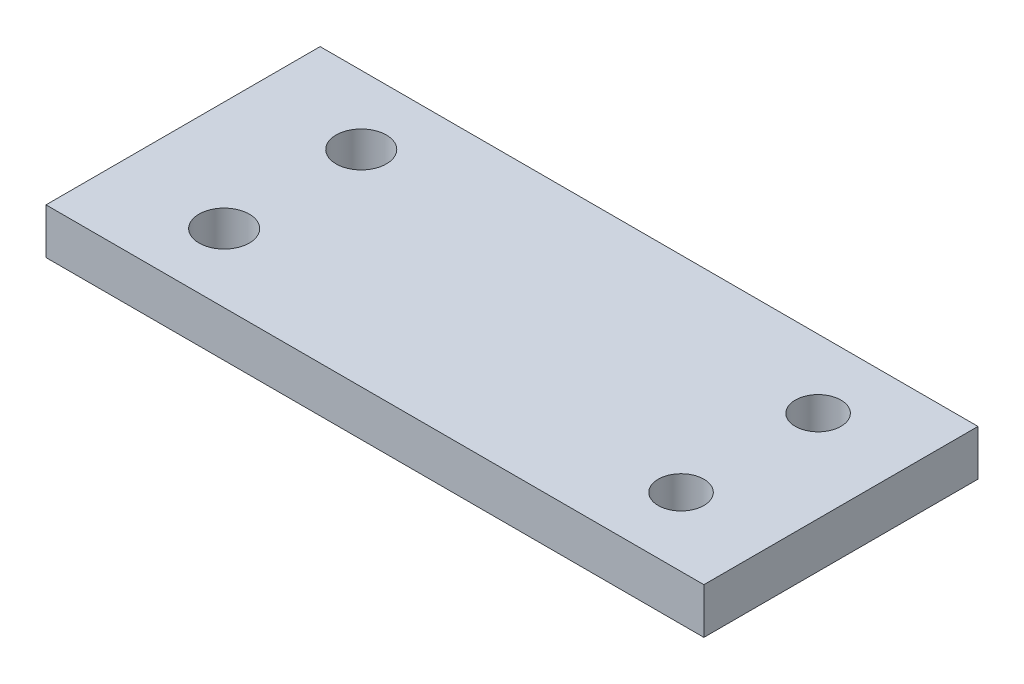
ISO-10303-21;
HEADER;
FILE_DESCRIPTION(('STEP AP214'),'2;1');
FILE_NAME('part.step','',(''),(''),'','','');
FILE_SCHEMA(('AUTOMOTIVE_DESIGN { 1 0 10303 214 1 1 1 1 }'));
ENDSEC;
DATA;
#1=APPLICATION_CONTEXT('core data for automotive mechanical design processes');
#2=APPLICATION_PROTOCOL_DEFINITION('international standard','automotive_design',2000,#1);
#3=PRODUCT_CONTEXT('',#1,'mechanical');
#4=PRODUCT('Part','Part','',(#3));
#5=PRODUCT_RELATED_PRODUCT_CATEGORY('part','',(#4));
#6=PRODUCT_DEFINITION_FORMATION('','',#4);
#7=PRODUCT_DEFINITION_CONTEXT('part definition',#1,'design');
#8=PRODUCT_DEFINITION('design','',#6,#7);
#9=PRODUCT_DEFINITION_SHAPE('','',#8);
#10=(LENGTH_UNIT() NAMED_UNIT(*) SI_UNIT(.MILLI.,.METRE.));
#11=(NAMED_UNIT(*) PLANE_ANGLE_UNIT() SI_UNIT($,.RADIAN.));
#12=(NAMED_UNIT(*) SI_UNIT($,.STERADIAN.) SOLID_ANGLE_UNIT());
#13=UNCERTAINTY_MEASURE_WITH_UNIT(LENGTH_MEASURE(1.E-05),#10,'distance_accuracy_value','');
#14=(GEOMETRIC_REPRESENTATION_CONTEXT(3) GLOBAL_UNCERTAINTY_ASSIGNED_CONTEXT((#13)) GLOBAL_UNIT_ASSIGNED_CONTEXT((#10,
#11,#12)) REPRESENTATION_CONTEXT('',''));
#15=CARTESIAN_POINT('',(0.,0.,0.));
#16=DIRECTION('',(0.,0.,1.));
#17=DIRECTION('',(1.,0.,0.));
#18=AXIS2_PLACEMENT_3D('',#15,#16,#17);
#19=CARTESIAN_POINT('',(36.,5.,-15.));
#20=DIRECTION('',(-1.,0.,0.));
#21=DIRECTION('',(0.,0.,1.));
#22=AXIS2_PLACEMENT_3D('',#19,#20,#21);
#23=PLANE('',#22);
#24=DIRECTION('',(0.,0.,-1.));
#25=VECTOR('',#24,1.);
#26=CARTESIAN_POINT('',(36.,0.,-15.));
#27=LINE('',#26,#25);
#28=CARTESIAN_POINT('',(36.,0.,15.));
#29=VERTEX_POINT('',#28);
#30=CARTESIAN_POINT('',(36.,0.,-15.));
#31=VERTEX_POINT('',#30);
#32=EDGE_CURVE('E97',#29,#31,#27,.T.);
#33=ORIENTED_EDGE('',*,*,#32,.T.);
#34=DIRECTION('',(0.,-1.,0.));
#35=VECTOR('',#34,1.);
#36=CARTESIAN_POINT('',(36.,5.,-15.));
#37=LINE('',#36,#35);
#38=CARTESIAN_POINT('',(36.,5.,-15.));
#39=VERTEX_POINT('',#38);
#40=EDGE_CURVE('E11',#39,#31,#37,.T.);
#41=ORIENTED_EDGE('',*,*,#40,.F.);
#42=DIRECTION('',(0.,0.,-1.));
#43=VECTOR('',#42,1.);
#44=CARTESIAN_POINT('',(36.,5.,-15.));
#45=LINE('',#44,#43);
#46=CARTESIAN_POINT('',(36.,5.,15.));
#47=VERTEX_POINT('',#46);
#48=EDGE_CURVE('E85',#47,#39,#45,.T.);
#49=ORIENTED_EDGE('',*,*,#48,.F.);
#50=DIRECTION('',(0.,-1.,0.));
#51=VECTOR('',#50,1.);
#52=CARTESIAN_POINT('',(36.,5.,15.));
#53=LINE('',#52,#51);
#54=EDGE_CURVE('E93',#47,#29,#53,.T.);
#55=ORIENTED_EDGE('',*,*,#54,.T.);
#56=EDGE_LOOP('',(#33,#41,#49,#55));
#57=FACE_BOUND('',#56,.T.);
#58=ADVANCED_FACE('F34',(#57),#23,.F.);
#59=CARTESIAN_POINT('',(-36.,5.,-15.));
#60=DIRECTION('',(0.,0.,1.));
#61=DIRECTION('',(1.,0.,0.));
#62=AXIS2_PLACEMENT_3D('',#59,#60,#61);
#63=PLANE('',#62);
#64=DIRECTION('',(-1.,0.,0.));
#65=VECTOR('',#64,1.);
#66=CARTESIAN_POINT('',(-36.,0.,-15.));
#67=LINE('',#66,#65);
#68=CARTESIAN_POINT('',(-36.,0.,-15.));
#69=VERTEX_POINT('',#68);
#70=EDGE_CURVE('E89',#31,#69,#67,.T.);
#71=ORIENTED_EDGE('',*,*,#70,.T.);
#72=DIRECTION('',(0.,-1.,0.));
#73=VECTOR('',#72,1.);
#74=CARTESIAN_POINT('',(-36.,5.,-15.));
#75=LINE('',#74,#73);
#76=CARTESIAN_POINT('',(-36.,5.,-15.));
#77=VERTEX_POINT('',#76);
#78=EDGE_CURVE('E42',#77,#69,#75,.T.);
#79=ORIENTED_EDGE('',*,*,#78,.F.);
#80=DIRECTION('',(-1.,0.,0.));
#81=VECTOR('',#80,1.);
#82=CARTESIAN_POINT('',(-36.,5.,-15.));
#83=LINE('',#82,#81);
#84=EDGE_CURVE('E80',#39,#77,#83,.T.);
#85=ORIENTED_EDGE('',*,*,#84,.F.);
#86=ORIENTED_EDGE('',*,*,#40,.T.);
#87=EDGE_LOOP('',(#71,#79,#85,#86));
#88=FACE_BOUND('',#87,.T.);
#89=ADVANCED_FACE('F88',(#88),#63,.F.);
#90=CARTESIAN_POINT('',(-36.,5.,-15.));
#91=DIRECTION('',(1.,0.,0.));
#92=DIRECTION('',(0.,0.,-1.));
#93=AXIS2_PLACEMENT_3D('',#90,#91,#92);
#94=PLANE('',#93);
#95=DIRECTION('',(0.,0.,1.));
#96=VECTOR('',#95,1.);
#97=CARTESIAN_POINT('',(-36.,0.,-15.));
#98=LINE('',#97,#96);
#99=CARTESIAN_POINT('',(-36.,0.,15.));
#100=VERTEX_POINT('',#99);
#101=EDGE_CURVE('E67',#69,#100,#98,.T.);
#102=ORIENTED_EDGE('',*,*,#101,.T.);
#103=DIRECTION('',(0.,-1.,0.));
#104=VECTOR('',#103,1.);
#105=CARTESIAN_POINT('',(-36.,5.,15.));
#106=LINE('',#105,#104);
#107=CARTESIAN_POINT('',(-36.,5.,15.));
#108=VERTEX_POINT('',#107);
#109=EDGE_CURVE('E90',#108,#100,#106,.T.);
#110=ORIENTED_EDGE('',*,*,#109,.F.);
#111=DIRECTION('',(0.,0.,1.));
#112=VECTOR('',#111,1.);
#113=CARTESIAN_POINT('',(-36.,5.,-15.));
#114=LINE('',#113,#112);
#115=EDGE_CURVE('E83',#77,#108,#114,.T.);
#116=ORIENTED_EDGE('',*,*,#115,.F.);
#117=ORIENTED_EDGE('',*,*,#78,.T.);
#118=EDGE_LOOP('',(#102,#110,#116,#117));
#119=FACE_BOUND('',#118,.T.);
#120=ADVANCED_FACE('F91',(#119),#94,.F.);
#121=CARTESIAN_POINT('',(-36.,5.,15.));
#122=DIRECTION('',(0.,0.,-1.));
#123=DIRECTION('',(-1.,0.,0.));
#124=AXIS2_PLACEMENT_3D('',#121,#122,#123);
#125=PLANE('',#124);
#126=DIRECTION('',(1.,0.,0.));
#127=VECTOR('',#126,1.);
#128=CARTESIAN_POINT('',(-36.,0.,15.));
#129=LINE('',#128,#127);
#130=EDGE_CURVE('E73',#100,#29,#129,.T.);
#131=ORIENTED_EDGE('',*,*,#130,.T.);
#132=ORIENTED_EDGE('',*,*,#54,.F.);
#133=DIRECTION('',(1.,0.,0.));
#134=VECTOR('',#133,1.);
#135=CARTESIAN_POINT('',(-36.,5.,15.));
#136=LINE('',#135,#134);
#137=EDGE_CURVE('E50',#108,#47,#136,.T.);
#138=ORIENTED_EDGE('',*,*,#137,.F.);
#139=ORIENTED_EDGE('',*,*,#109,.T.);
#140=EDGE_LOOP('',(#131,#132,#138,#139));
#141=FACE_BOUND('',#140,.T.);
#142=ADVANCED_FACE('F105',(#141),#125,.F.);
#143=CARTESIAN_POINT('',(0.,5.,0.));
#144=DIRECTION('',(0.,1.,0.));
#145=DIRECTION('',(0.,0.,1.));
#146=AXIS2_PLACEMENT_3D('',#143,#144,#145);
#147=PLANE('',#146);
#148=CARTESIAN_POINT('',(-24.,5.,7.5));
#149=DIRECTION('',(0.,1.,0.));
#150=DIRECTION('',(0.,0.,1.));
#151=AXIS2_PLACEMENT_3D('',#148,#149,#150);
#152=CIRCLE('',#151,2.75);
#153=CARTESIAN_POINT('',(-24.,5.,10.25));
#154=VERTEX_POINT('',#153);
#155=EDGE_CURVE('E129',#154,#154,#152,.T.);
#156=ORIENTED_EDGE('',*,*,#155,.F.);
#157=EDGE_LOOP('',(#156));
#158=FACE_BOUND('',#157,.T.);
#159=CARTESIAN_POINT('',(26.,5.,-7.5));
#160=DIRECTION('',(0.,1.,0.));
#161=DIRECTION('',(0.,0.,1.));
#162=AXIS2_PLACEMENT_3D('',#159,#160,#161);
#163=CIRCLE('',#162,2.5);
#164=CARTESIAN_POINT('',(26.,5.,-5.));
#165=VERTEX_POINT('',#164);
#166=EDGE_CURVE('E123',#165,#165,#163,.T.);
#167=ORIENTED_EDGE('',*,*,#166,.F.);
#168=EDGE_LOOP('',(#167));
#169=FACE_BOUND('',#168,.T.);
#170=CARTESIAN_POINT('',(26.,5.,7.5));
#171=DIRECTION('',(0.,1.,0.));
#172=DIRECTION('',(0.,0.,1.));
#173=AXIS2_PLACEMENT_3D('',#170,#171,#172);
#174=CIRCLE('',#173,2.5);
#175=CARTESIAN_POINT('',(26.,5.,10.));
#176=VERTEX_POINT('',#175);
#177=EDGE_CURVE('E117',#176,#176,#174,.T.);
#178=ORIENTED_EDGE('',*,*,#177,.F.);
#179=EDGE_LOOP('',(#178));
#180=FACE_BOUND('',#179,.T.);
#181=CARTESIAN_POINT('',(-24.,5.,-7.5));
#182=DIRECTION('',(0.,1.,0.));
#183=DIRECTION('',(0.,0.,1.));
#184=AXIS2_PLACEMENT_3D('',#181,#182,#183);
#185=CIRCLE('',#184,2.75);
#186=CARTESIAN_POINT('',(-24.,5.,-4.75));
#187=VERTEX_POINT('',#186);
#188=EDGE_CURVE('E111',#187,#187,#185,.T.);
#189=ORIENTED_EDGE('',*,*,#188,.F.);
#190=EDGE_LOOP('',(#189));
#191=FACE_BOUND('',#190,.T.);
#192=ORIENTED_EDGE('',*,*,#48,.T.);
#193=ORIENTED_EDGE('',*,*,#84,.T.);
#194=ORIENTED_EDGE('',*,*,#115,.T.);
#195=ORIENTED_EDGE('',*,*,#137,.T.);
#196=EDGE_LOOP('',(#192,#193,#194,#195));
#197=FACE_BOUND('',#196,.T.);
#198=ADVANCED_FACE('F81',(#158,#169,#180,#191,#197),#147,.T.);
#199=CARTESIAN_POINT('',(0.,0.,0.));
#200=DIRECTION('',(0.,1.,0.));
#201=DIRECTION('',(0.,0.,1.));
#202=AXIS2_PLACEMENT_3D('',#199,#200,#201);
#203=PLANE('',#202);
#204=CARTESIAN_POINT('',(-24.,0.,7.5));
#205=DIRECTION('',(0.,1.,0.));
#206=DIRECTION('',(0.,0.,1.));
#207=AXIS2_PLACEMENT_3D('',#204,#205,#206);
#208=CIRCLE('',#207,2.75);
#209=CARTESIAN_POINT('',(-24.,0.,10.25));
#210=VERTEX_POINT('',#209);
#211=EDGE_CURVE('E114',#210,#210,#208,.T.);
#212=ORIENTED_EDGE('',*,*,#211,.T.);
#213=EDGE_LOOP('',(#212));
#214=FACE_BOUND('',#213,.T.);
#215=CARTESIAN_POINT('',(26.,0.,-7.5));
#216=DIRECTION('',(0.,1.,0.));
#217=DIRECTION('',(0.,0.,1.));
#218=AXIS2_PLACEMENT_3D('',#215,#216,#217);
#219=CIRCLE('',#218,2.5);
#220=CARTESIAN_POINT('',(26.,0.,-5.));
#221=VERTEX_POINT('',#220);
#222=EDGE_CURVE('E126',#221,#221,#219,.T.);
#223=ORIENTED_EDGE('',*,*,#222,.T.);
#224=EDGE_LOOP('',(#223));
#225=FACE_BOUND('',#224,.T.);
#226=CARTESIAN_POINT('',(26.,0.,7.5));
#227=DIRECTION('',(0.,1.,0.));
#228=DIRECTION('',(0.,0.,1.));
#229=AXIS2_PLACEMENT_3D('',#226,#227,#228);
#230=CIRCLE('',#229,2.5);
#231=CARTESIAN_POINT('',(26.,0.,10.));
#232=VERTEX_POINT('',#231);
#233=EDGE_CURVE('E120',#232,#232,#230,.T.);
#234=ORIENTED_EDGE('',*,*,#233,.T.);
#235=EDGE_LOOP('',(#234));
#236=FACE_BOUND('',#235,.T.);
#237=CARTESIAN_POINT('',(-24.,0.,-7.5));
#238=DIRECTION('',(0.,1.,0.));
#239=DIRECTION('',(0.,0.,1.));
#240=AXIS2_PLACEMENT_3D('',#237,#238,#239);
#241=CIRCLE('',#240,2.75);
#242=CARTESIAN_POINT('',(-24.,0.,-4.75));
#243=VERTEX_POINT('',#242);
#244=EDGE_CURVE('E100',#243,#243,#241,.T.);
#245=ORIENTED_EDGE('',*,*,#244,.T.);
#246=EDGE_LOOP('',(#245));
#247=FACE_BOUND('',#246,.T.);
#248=ORIENTED_EDGE('',*,*,#32,.F.);
#249=ORIENTED_EDGE('',*,*,#130,.F.);
#250=ORIENTED_EDGE('',*,*,#101,.F.);
#251=ORIENTED_EDGE('',*,*,#70,.F.);
#252=EDGE_LOOP('',(#248,#249,#250,#251));
#253=FACE_BOUND('',#252,.T.);
#254=ADVANCED_FACE('F108',(#214,#225,#236,#247,#253),#203,.F.);
#255=CARTESIAN_POINT('',(-24.,0.,-7.5));
#256=DIRECTION('',(0.,1.,0.));
#257=DIRECTION('',(0.,0.,1.));
#258=AXIS2_PLACEMENT_3D('',#255,#256,#257);
#259=CYLINDRICAL_SURFACE('',#258,2.75);
#260=ORIENTED_EDGE('',*,*,#244,.F.);
#261=EDGE_LOOP('',(#260));
#262=FACE_BOUND('',#261,.T.);
#263=ORIENTED_EDGE('',*,*,#188,.T.);
#264=EDGE_LOOP('',(#263));
#265=FACE_BOUND('',#264,.T.);
#266=ADVANCED_FACE('F153',(#262,#265),#259,.F.);
#267=CARTESIAN_POINT('',(26.,0.,7.5));
#268=DIRECTION('',(0.,1.,0.));
#269=DIRECTION('',(0.,0.,1.));
#270=AXIS2_PLACEMENT_3D('',#267,#268,#269);
#271=CYLINDRICAL_SURFACE('',#270,2.5);
#272=ORIENTED_EDGE('',*,*,#233,.F.);
#273=EDGE_LOOP('',(#272));
#274=FACE_BOUND('',#273,.T.);
#275=ORIENTED_EDGE('',*,*,#177,.T.);
#276=EDGE_LOOP('',(#275));
#277=FACE_BOUND('',#276,.T.);
#278=ADVANCED_FACE('F155',(#274,#277),#271,.F.);
#279=CARTESIAN_POINT('',(26.,0.,-7.5));
#280=DIRECTION('',(0.,1.,0.));
#281=DIRECTION('',(0.,0.,1.));
#282=AXIS2_PLACEMENT_3D('',#279,#280,#281);
#283=CYLINDRICAL_SURFACE('',#282,2.5);
#284=ORIENTED_EDGE('',*,*,#222,.F.);
#285=EDGE_LOOP('',(#284));
#286=FACE_BOUND('',#285,.T.);
#287=ORIENTED_EDGE('',*,*,#166,.T.);
#288=EDGE_LOOP('',(#287));
#289=FACE_BOUND('',#288,.T.);
#290=ADVANCED_FACE('F140',(#286,#289),#283,.F.);
#291=CARTESIAN_POINT('',(-24.,0.,7.5));
#292=DIRECTION('',(0.,1.,0.));
#293=DIRECTION('',(0.,0.,1.));
#294=AXIS2_PLACEMENT_3D('',#291,#292,#293);
#295=CYLINDRICAL_SURFACE('',#294,2.75);
#296=ORIENTED_EDGE('',*,*,#211,.F.);
#297=EDGE_LOOP('',(#296));
#298=FACE_BOUND('',#297,.T.);
#299=ORIENTED_EDGE('',*,*,#155,.T.);
#300=EDGE_LOOP('',(#299));
#301=FACE_BOUND('',#300,.T.);
#302=ADVANCED_FACE('F137',(#298,#301),#295,.F.);
#303=CLOSED_SHELL('',(#58,#89,#120,#142,#198,#254,#266,#278,#290,#302));
#304=MANIFOLD_SOLID_BREP('B2',#303);
#305=ADVANCED_BREP_SHAPE_REPRESENTATION('',(#18,#304),#14);
#306=SHAPE_DEFINITION_REPRESENTATION(#9,#305);
ENDSEC;
END-ISO-10303-21;
